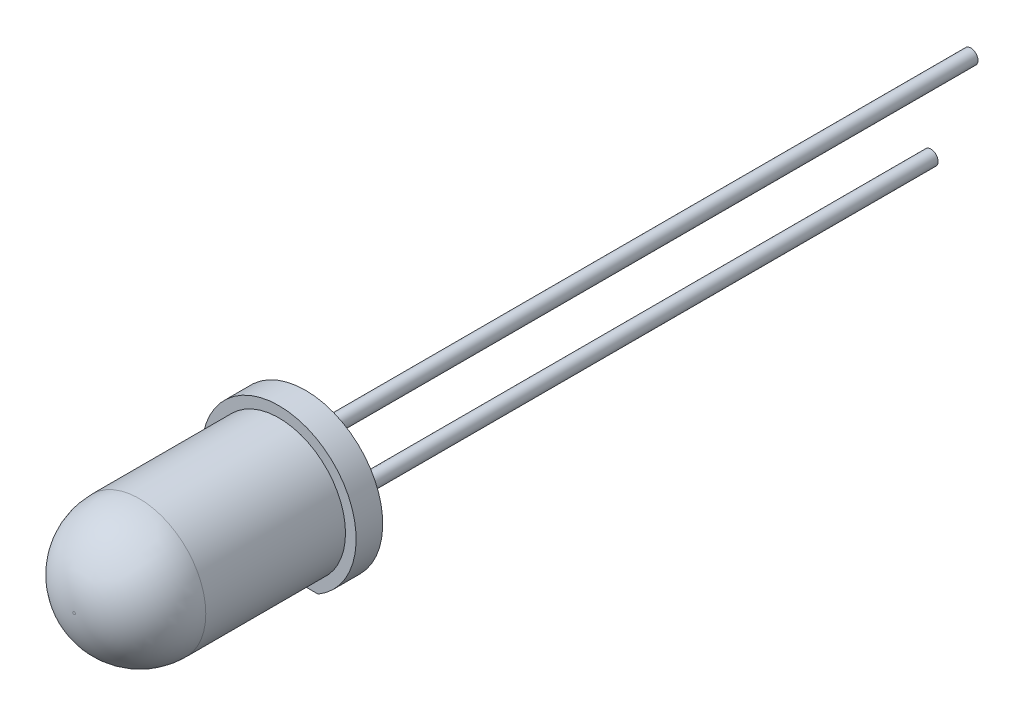
ISO-10303-21;
HEADER;
FILE_DESCRIPTION(('STEP AP214'),'2;1');
FILE_NAME('part.step','',(''),(''),'','','');
FILE_SCHEMA(('AUTOMOTIVE_DESIGN { 1 0 10303 214 1 1 1 1 }'));
ENDSEC;
DATA;
#1=APPLICATION_CONTEXT('core data for automotive mechanical design processes');
#2=APPLICATION_PROTOCOL_DEFINITION('international standard','automotive_design',2000,#1);
#3=PRODUCT_CONTEXT('',#1,'mechanical');
#4=PRODUCT('Part','Part','',(#3));
#5=PRODUCT_RELATED_PRODUCT_CATEGORY('part','',(#4));
#6=PRODUCT_DEFINITION_FORMATION('','',#4);
#7=PRODUCT_DEFINITION_CONTEXT('part definition',#1,'design');
#8=PRODUCT_DEFINITION('design','',#6,#7);
#9=PRODUCT_DEFINITION_SHAPE('','',#8);
#10=(LENGTH_UNIT() NAMED_UNIT(*) SI_UNIT(.MILLI.,.METRE.));
#11=(NAMED_UNIT(*) PLANE_ANGLE_UNIT() SI_UNIT($,.RADIAN.));
#12=(NAMED_UNIT(*) SI_UNIT($,.STERADIAN.) SOLID_ANGLE_UNIT());
#13=UNCERTAINTY_MEASURE_WITH_UNIT(LENGTH_MEASURE(1.E-05),#10,'distance_accuracy_value','');
#14=(GEOMETRIC_REPRESENTATION_CONTEXT(3) GLOBAL_UNCERTAINTY_ASSIGNED_CONTEXT((#13)) GLOBAL_UNIT_ASSIGNED_CONTEXT((#10,
#11,#12)) REPRESENTATION_CONTEXT('',''));
#15=CARTESIAN_POINT('',(0.,0.,0.));
#16=DIRECTION('',(0.,0.,1.));
#17=DIRECTION('',(1.,0.,0.));
#18=AXIS2_PLACEMENT_3D('',#15,#16,#17);
#19=CARTESIAN_POINT('',(-0.28,0.99,0.));
#20=DIRECTION('',(0.,0.,1.));
#21=DIRECTION('',(1.,0.,0.));
#22=AXIS2_PLACEMENT_3D('',#19,#20,#21);
#23=PLANE('',#22);
#24=CARTESIAN_POINT('',(0.,1.27,0.));
#25=DIRECTION('',(0.,0.,-1.));
#26=DIRECTION('',(-1.,0.,0.));
#27=AXIS2_PLACEMENT_3D('',#24,#25,#26);
#28=CIRCLE('',#27,0.27);
#29=CARTESIAN_POINT('',(-0.27,1.27,0.));
#30=VERTEX_POINT('',#29);
#31=EDGE_CURVE('P0_E19',#30,#30,#28,.T.);
#32=ORIENTED_EDGE('',*,*,#31,.F.);
#33=EDGE_LOOP('',(#32));
#34=FACE_BOUND('',#33,.T.);
#35=ADVANCED_FACE('P0_F15',(#34),#23,.T.);
#36=CARTESIAN_POINT('',(0.28,0.99,-25.));
#37=DIRECTION('',(0.,0.,-1.));
#38=DIRECTION('',(-1.,0.,0.));
#39=AXIS2_PLACEMENT_3D('',#36,#37,#38);
#40=PLANE('',#39);
#41=CARTESIAN_POINT('',(0.,1.27,-25.));
#42=DIRECTION('',(0.,0.,-1.));
#43=DIRECTION('',(-1.,0.,0.));
#44=AXIS2_PLACEMENT_3D('',#41,#42,#43);
#45=CIRCLE('',#44,0.27);
#46=CARTESIAN_POINT('',(-0.27,1.27,-25.));
#47=VERTEX_POINT('',#46);
#48=EDGE_CURVE('P0_E10',#47,#47,#45,.F.);
#49=ORIENTED_EDGE('',*,*,#48,.F.);
#50=EDGE_LOOP('',(#49));
#51=FACE_BOUND('',#50,.T.);
#52=ADVANCED_FACE('P0_F30',(#51),#40,.T.);
#53=CARTESIAN_POINT('',(0.,1.27,0.));
#54=DIRECTION('',(0.,0.,-1.));
#55=DIRECTION('',(-1.,0.,0.));
#56=AXIS2_PLACEMENT_3D('',#53,#54,#55);
#57=CYLINDRICAL_SURFACE('',#56,0.27);
#58=ORIENTED_EDGE('',*,*,#48,.T.);
#59=EDGE_LOOP('',(#58));
#60=FACE_BOUND('',#59,.T.);
#61=ORIENTED_EDGE('',*,*,#31,.T.);
#62=EDGE_LOOP('',(#61));
#63=FACE_BOUND('',#62,.T.);
#64=ADVANCED_FACE('P0_F17',(#60,#63),#57,.T.);
#65=CLOSED_SHELL('',(#35,#52,#64));
#66=MANIFOLD_SOLID_BREP('P0_B1',#65);
#67=CARTESIAN_POINT('',(-1.47969384566991,-2.5,-0.01));
#68=DIRECTION('',(0.,-1.,0.));
#69=DIRECTION('',(1.,0.,0.));
#70=AXIS2_PLACEMENT_3D('',#67,#68,#69);
#71=PLANE('',#70);
#72=DIRECTION('',(-1.,0.,0.));
#73=VECTOR('',#72,1.);
#74=CARTESIAN_POINT('',(0.,-2.5,0.));
#75=LINE('',#74,#73);
#76=CARTESIAN_POINT('',(1.46969384566991,-2.5,0.));
#77=VERTEX_POINT('',#76);
#78=CARTESIAN_POINT('',(-1.4696938456699,-2.5,0.));
#79=VERTEX_POINT('',#78);
#80=EDGE_CURVE('P1_E68',#77,#79,#75,.T.);
#81=ORIENTED_EDGE('',*,*,#80,.F.);
#82=DIRECTION('',(0.,0.,1.));
#83=VECTOR('',#82,1.);
#84=CARTESIAN_POINT('',(1.46969384566991,-2.5,0.5));
#85=LINE('',#84,#83);
#86=CARTESIAN_POINT('',(1.46969384566991,-2.5,1.));
#87=VERTEX_POINT('',#86);
#88=EDGE_CURVE('P1_E34',#77,#87,#85,.T.);
#89=ORIENTED_EDGE('',*,*,#88,.T.);
#90=DIRECTION('',(-1.,0.,0.));
#91=VECTOR('',#90,1.);
#92=CARTESIAN_POINT('',(0.,-2.5,1.));
#93=LINE('',#92,#91);
#94=CARTESIAN_POINT('',(0.,-2.5,1.));
#95=VERTEX_POINT('',#94);
#96=EDGE_CURVE('P1_E62',#87,#95,#93,.T.);
#97=ORIENTED_EDGE('',*,*,#96,.T.);
#98=DIRECTION('',(-1.,0.,0.));
#99=VECTOR('',#98,1.);
#100=CARTESIAN_POINT('',(0.,-2.5,1.));
#101=LINE('',#100,#99);
#102=CARTESIAN_POINT('',(-1.4696938456699,-2.5,1.));
#103=VERTEX_POINT('',#102);
#104=EDGE_CURVE('P1_E58',#95,#103,#101,.T.);
#105=ORIENTED_EDGE('',*,*,#104,.T.);
#106=DIRECTION('',(0.,0.,-1.));
#107=VECTOR('',#106,1.);
#108=CARTESIAN_POINT('',(-1.46969384566991,-2.5,0.5));
#109=LINE('',#108,#107);
#110=EDGE_CURVE('P1_E61',#103,#79,#109,.T.);
#111=ORIENTED_EDGE('',*,*,#110,.T.);
#112=EDGE_LOOP('',(#81,#89,#97,#105,#111));
#113=FACE_BOUND('',#112,.T.);
#114=ADVANCED_FACE('P1_F17',(#113),#71,.T.);
#115=CARTESIAN_POINT('',(3.39021865408814,-2.51,0.));
#116=DIRECTION('',(0.,0.,-1.));
#117=DIRECTION('',(-1.,0.,0.));
#118=AXIS2_PLACEMENT_3D('',#115,#116,#117);
#119=PLANE('',#118);
#120=ORIENTED_EDGE('',*,*,#80,.T.);
#121=CARTESIAN_POINT('',(0.,0.,0.));
#122=DIRECTION('',(0.,0.,-1.));
#123=DIRECTION('',(-1.,0.,0.));
#124=AXIS2_PLACEMENT_3D('',#121,#122,#123);
#125=CIRCLE('',#124,2.9);
#126=EDGE_CURVE('P1_E21',#77,#79,#125,.F.);
#127=ORIENTED_EDGE('',*,*,#126,.F.);
#128=EDGE_LOOP('',(#120,#127));
#129=FACE_BOUND('',#128,.T.);
#130=ADVANCED_FACE('P1_F74',(#129),#119,.T.);
#131=CARTESIAN_POINT('',(0.,0.,1.));
#132=DIRECTION('',(0.,0.,-1.));
#133=DIRECTION('',(-1.,0.,0.));
#134=AXIS2_PLACEMENT_3D('',#131,#132,#133);
#135=CYLINDRICAL_SURFACE('',#134,2.9);
#136=ORIENTED_EDGE('',*,*,#88,.F.);
#137=ORIENTED_EDGE('',*,*,#126,.T.);
#138=ORIENTED_EDGE('',*,*,#110,.F.);
#139=CARTESIAN_POINT('',(0.,0.,1.));
#140=DIRECTION('',(0.,0.,-1.));
#141=DIRECTION('',(-1.,0.,0.));
#142=AXIS2_PLACEMENT_3D('',#139,#140,#141);
#143=CIRCLE('',#142,2.9);
#144=EDGE_CURVE('P1_E54',#87,#103,#143,.F.);
#145=ORIENTED_EDGE('',*,*,#144,.F.);
#146=EDGE_LOOP('',(#136,#137,#138,#145));
#147=FACE_BOUND('',#146,.T.);
#148=ADVANCED_FACE('P1_F76',(#147),#135,.T.);
#149=CARTESIAN_POINT('',(3.39021865408814,2.91,1.));
#150=DIRECTION('',(0.,0.,1.));
#151=DIRECTION('',(-1.,0.,0.));
#152=AXIS2_PLACEMENT_3D('',#149,#150,#151);
#153=PLANE('',#152);
#154=CARTESIAN_POINT('',(0.,0.,1.));
#155=DIRECTION('',(0.,0.,1.));
#156=DIRECTION('',(1.,0.,0.));
#157=AXIS2_PLACEMENT_3D('',#154,#155,#156);
#158=CIRCLE('',#157,2.5);
#159=EDGE_CURVE('P1_E48',#95,#95,#158,.T.);
#160=ORIENTED_EDGE('',*,*,#159,.F.);
#161=ORIENTED_EDGE('',*,*,#96,.F.);
#162=ORIENTED_EDGE('',*,*,#144,.T.);
#163=ORIENTED_EDGE('',*,*,#104,.F.);
#164=EDGE_LOOP('',(#160,#161,#162,#163));
#165=FACE_BOUND('',#164,.T.);
#166=ADVANCED_FACE('P1_F59',(#165),#153,.T.);
#167=CARTESIAN_POINT('',(-0.0599999999999997,-0.0599999999999997,8.7));
#168=DIRECTION('',(0.,0.,1.));
#169=DIRECTION('',(1.,0.,0.));
#170=AXIS2_PLACEMENT_3D('',#167,#168,#169);
#171=PLANE('',#170);
#172=CARTESIAN_POINT('',(0.,0.,8.7));
#173=DIRECTION('',(0.,0.,1.));
#174=DIRECTION('',(1.,0.,0.));
#175=AXIS2_PLACEMENT_3D('',#172,#173,#174);
#176=CIRCLE('',#175,0.0500000000000002);
#177=CARTESIAN_POINT('',(0.0500000000000002,0.,8.7));
#178=VERTEX_POINT('',#177);
#179=EDGE_CURVE('P1_E27',#178,#178,#176,.F.);
#180=ORIENTED_EDGE('',*,*,#179,.F.);
#181=EDGE_LOOP('',(#180));
#182=FACE_BOUND('',#181,.T.);
#183=ADVANCED_FACE('P1_F90',(#182),#171,.T.);
#184=CARTESIAN_POINT('',(0.,0.,1.));
#185=DIRECTION('',(0.,0.,1.));
#186=DIRECTION('',(1.,0.,0.));
#187=AXIS2_PLACEMENT_3D('',#184,#185,#186);
#188=CYLINDRICAL_SURFACE('',#187,2.5);
#189=ORIENTED_EDGE('',*,*,#159,.T.);
#190=EDGE_LOOP('',(#189));
#191=FACE_BOUND('',#190,.T.);
#192=CARTESIAN_POINT('',(0.,0.,6.25));
#193=DIRECTION('',(0.,0.,1.));
#194=DIRECTION('',(1.,0.,0.));
#195=AXIS2_PLACEMENT_3D('',#192,#193,#194);
#196=CIRCLE('',#195,2.5);
#197=CARTESIAN_POINT('',(2.5,0.,6.25));
#198=VERTEX_POINT('',#197);
#199=EDGE_CURVE('P1_E11',#198,#198,#196,.T.);
#200=ORIENTED_EDGE('',*,*,#199,.F.);
#201=EDGE_LOOP('',(#200));
#202=FACE_BOUND('',#201,.T.);
#203=ADVANCED_FACE('P1_F50',(#191,#202),#188,.T.);
#204=CARTESIAN_POINT('',(0.,0.,6.25));
#205=DIRECTION('',(0.,0.,1.));
#206=DIRECTION('',(1.,0.,0.));
#207=AXIS2_PLACEMENT_3D('',#204,#205,#206);
#208=DEGENERATE_TOROIDAL_SURFACE('',#207,0.05,2.45,.T.);
#209=ORIENTED_EDGE('',*,*,#199,.T.);
#210=EDGE_LOOP('',(#209));
#211=FACE_BOUND('',#210,.T.);
#212=ORIENTED_EDGE('',*,*,#179,.T.);
#213=EDGE_LOOP('',(#212));
#214=FACE_BOUND('',#213,.T.);
#215=ADVANCED_FACE('P1_F19',(#211,#214),#208,.T.);
#216=CLOSED_SHELL('',(#114,#130,#148,#166,#183,#203,#215));
#217=MANIFOLD_SOLID_BREP('P1_B1',#216);
#218=CARTESIAN_POINT('',(-0.28,-1.55,0.));
#219=DIRECTION('',(0.,0.,1.));
#220=DIRECTION('',(1.,0.,0.));
#221=AXIS2_PLACEMENT_3D('',#218,#219,#220);
#222=PLANE('',#221);
#223=CARTESIAN_POINT('',(0.,-1.27,0.));
#224=DIRECTION('',(0.,0.,-1.));
#225=DIRECTION('',(-1.,0.,0.));
#226=AXIS2_PLACEMENT_3D('',#223,#224,#225);
#227=CIRCLE('',#226,0.27);
#228=CARTESIAN_POINT('',(-0.27,-1.27,0.));
#229=VERTEX_POINT('',#228);
#230=EDGE_CURVE('P2_E18',#229,#229,#227,.T.);
#231=ORIENTED_EDGE('',*,*,#230,.F.);
#232=EDGE_LOOP('',(#231));
#233=FACE_BOUND('',#232,.T.);
#234=ADVANCED_FACE('P2_F14',(#233),#222,.T.);
#235=CARTESIAN_POINT('',(0.,-1.27,0.));
#236=DIRECTION('',(0.,0.,-1.));
#237=DIRECTION('',(-1.,0.,0.));
#238=AXIS2_PLACEMENT_3D('',#235,#236,#237);
#239=CYLINDRICAL_SURFACE('',#238,0.27);
#240=CARTESIAN_POINT('',(0.,-1.27,-23.5));
#241=DIRECTION('',(0.,0.,-1.));
#242=DIRECTION('',(-1.,0.,0.));
#243=AXIS2_PLACEMENT_3D('',#240,#241,#242);
#244=CIRCLE('',#243,0.27);
#245=CARTESIAN_POINT('',(-0.27,-1.27,-23.5));
#246=VERTEX_POINT('',#245);
#247=EDGE_CURVE('P2_E9',#246,#246,#244,.T.);
#248=ORIENTED_EDGE('',*,*,#247,.F.);
#249=EDGE_LOOP('',(#248));
#250=FACE_BOUND('',#249,.T.);
#251=ORIENTED_EDGE('',*,*,#230,.T.);
#252=EDGE_LOOP('',(#251));
#253=FACE_BOUND('',#252,.T.);
#254=ADVANCED_FACE('P2_F27',(#250,#253),#239,.T.);
#255=CARTESIAN_POINT('',(0.28,-1.55,-23.5));
#256=DIRECTION('',(0.,0.,-1.));
#257=DIRECTION('',(-1.,0.,0.));
#258=AXIS2_PLACEMENT_3D('',#255,#256,#257);
#259=PLANE('',#258);
#260=ORIENTED_EDGE('',*,*,#247,.T.);
#261=EDGE_LOOP('',(#260));
#262=FACE_BOUND('',#261,.T.);
#263=ADVANCED_FACE('P2_F16',(#262),#259,.T.);
#264=CLOSED_SHELL('',(#234,#254,#263));
#265=MANIFOLD_SOLID_BREP('P2_B1',#264);
#266=ADVANCED_BREP_SHAPE_REPRESENTATION('',(#18,#66,#217,#265),#14);
#267=SHAPE_DEFINITION_REPRESENTATION(#9,#266);
ENDSEC;
END-ISO-10303-21;
